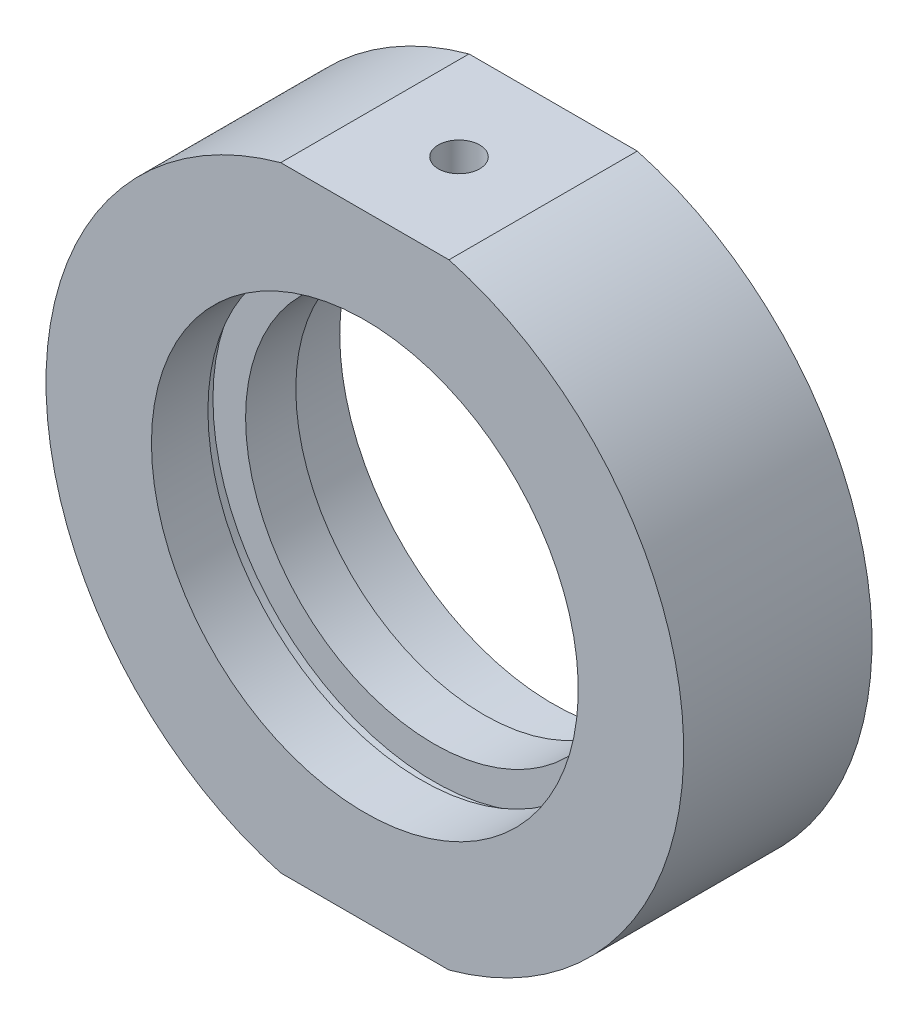
ISO-10303-21;
HEADER;
FILE_DESCRIPTION(('STEP AP214'),'2;1');
FILE_NAME('part.step','',(''),(''),'','','');
FILE_SCHEMA(('AUTOMOTIVE_DESIGN { 1 0 10303 214 1 1 1 1 }'));
ENDSEC;
DATA;
#1=APPLICATION_CONTEXT('core data for automotive mechanical design processes');
#2=APPLICATION_PROTOCOL_DEFINITION('international standard','automotive_design',2000,#1);
#3=PRODUCT_CONTEXT('',#1,'mechanical');
#4=PRODUCT('Part','Part','',(#3));
#5=PRODUCT_RELATED_PRODUCT_CATEGORY('part','',(#4));
#6=PRODUCT_DEFINITION_FORMATION('','',#4);
#7=PRODUCT_DEFINITION_CONTEXT('part definition',#1,'design');
#8=PRODUCT_DEFINITION('design','',#6,#7);
#9=PRODUCT_DEFINITION_SHAPE('','',#8);
#10=(LENGTH_UNIT() NAMED_UNIT(*) SI_UNIT(.MILLI.,.METRE.));
#11=(NAMED_UNIT(*) PLANE_ANGLE_UNIT() SI_UNIT($,.RADIAN.));
#12=(NAMED_UNIT(*) SI_UNIT($,.STERADIAN.) SOLID_ANGLE_UNIT());
#13=UNCERTAINTY_MEASURE_WITH_UNIT(LENGTH_MEASURE(1.E-05),#10,'distance_accuracy_value','');
#14=(GEOMETRIC_REPRESENTATION_CONTEXT(3) GLOBAL_UNCERTAINTY_ASSIGNED_CONTEXT((#13)) GLOBAL_UNIT_ASSIGNED_CONTEXT((#10,
#11,#12)) REPRESENTATION_CONTEXT('',''));
#15=CARTESIAN_POINT('',(0.,0.,0.));
#16=DIRECTION('',(0.,0.,1.));
#17=DIRECTION('',(1.,0.,0.));
#18=AXIS2_PLACEMENT_3D('',#15,#16,#17);
#19=CARTESIAN_POINT('',(0.,0.,-31.9390681003584));
#20=DIRECTION('',(0.,0.,-1.));
#21=DIRECTION('',(-1.,0.,0.));
#22=AXIS2_PLACEMENT_3D('',#19,#20,#21);
#23=CYLINDRICAL_SURFACE('',#22,25.4);
#24=CARTESIAN_POINT('',(0.,0.,7.49999999999999));
#25=DIRECTION('',(0.,0.,-1.));
#26=DIRECTION('',(-1.,0.,0.));
#27=AXIS2_PLACEMENT_3D('',#24,#25,#26);
#28=CIRCLE('',#27,25.4);
#29=CARTESIAN_POINT('',(6.7014923711066,24.5,7.5));
#30=VERTEX_POINT('',#29);
#31=CARTESIAN_POINT('',(6.7014923711066,-24.5,7.5));
#32=VERTEX_POINT('',#31);
#33=EDGE_CURVE('E154',#30,#32,#28,.T.);
#34=ORIENTED_EDGE('',*,*,#33,.T.);
#35=DIRECTION('',(0.,0.,-1.));
#36=VECTOR('',#35,1.);
#37=CARTESIAN_POINT('',(6.70149237110663,-24.5,-31.9390681003584));
#38=LINE('',#37,#36);
#39=CARTESIAN_POINT('',(6.7014923711066,-24.5,-7.5));
#40=VERTEX_POINT('',#39);
#41=EDGE_CURVE('E119',#32,#40,#38,.T.);
#42=ORIENTED_EDGE('',*,*,#41,.T.);
#43=CARTESIAN_POINT('',(0.,0.,-7.5));
#44=DIRECTION('',(0.,0.,-1.));
#45=DIRECTION('',(-1.,0.,0.));
#46=AXIS2_PLACEMENT_3D('',#43,#44,#45);
#47=CIRCLE('',#46,25.4);
#48=CARTESIAN_POINT('',(6.7014923711066,24.5,-7.5));
#49=VERTEX_POINT('',#48);
#50=EDGE_CURVE('E149',#49,#40,#47,.T.);
#51=ORIENTED_EDGE('',*,*,#50,.F.);
#52=DIRECTION('',(0.,0.,-1.));
#53=VECTOR('',#52,1.);
#54=CARTESIAN_POINT('',(6.70149237110663,24.5,-31.9390681003584));
#55=LINE('',#54,#53);
#56=EDGE_CURVE('E64',#49,#30,#55,.F.);
#57=ORIENTED_EDGE('',*,*,#56,.T.);
#58=EDGE_LOOP('',(#34,#42,#51,#57));
#59=FACE_BOUND('',#58,.T.);
#60=ADVANCED_FACE('F41',(#59),#23,.T.);
#61=CARTESIAN_POINT('',(15.,0.,-2.));
#62=DIRECTION('',(0.,0.,1.));
#63=DIRECTION('',(1.,0.,0.));
#64=AXIS2_PLACEMENT_3D('',#61,#62,#63);
#65=PLANE('',#64);
#66=CARTESIAN_POINT('',(0.,0.,-2.));
#67=DIRECTION('',(0.,0.,-1.));
#68=DIRECTION('',(-1.,0.,0.));
#69=AXIS2_PLACEMENT_3D('',#66,#67,#68);
#70=CIRCLE('',#69,15.);
#71=CARTESIAN_POINT('',(-15.,0.,-2.));
#72=VERTEX_POINT('',#71);
#73=EDGE_CURVE('E177',#72,#72,#70,.T.);
#74=ORIENTED_EDGE('',*,*,#73,.F.);
#75=EDGE_LOOP('',(#74));
#76=FACE_BOUND('',#75,.T.);
#77=CARTESIAN_POINT('',(0.,0.,-2.));
#78=DIRECTION('',(0.,0.,-1.));
#79=DIRECTION('',(-1.,0.,0.));
#80=AXIS2_PLACEMENT_3D('',#77,#78,#79);
#81=CIRCLE('',#80,17.6);
#82=CARTESIAN_POINT('',(-17.6,0.,-2.));
#83=VERTEX_POINT('',#82);
#84=EDGE_CURVE('E132',#83,#83,#81,.T.);
#85=ORIENTED_EDGE('',*,*,#84,.T.);
#86=EDGE_LOOP('',(#85));
#87=FACE_BOUND('',#86,.T.);
#88=ADVANCED_FACE('F43',(#76,#87),#65,.F.);
#89=CARTESIAN_POINT('',(0.,0.,-31.9390681003584));
#90=DIRECTION('',(0.,0.,-1.));
#91=DIRECTION('',(-1.,0.,0.));
#92=AXIS2_PLACEMENT_3D('',#89,#90,#91);
#93=CYLINDRICAL_SURFACE('',#92,15.);
#94=CARTESIAN_POINT('',(0.,0.,1.99999999999999));
#95=DIRECTION('',(0.,0.,-1.));
#96=DIRECTION('',(-1.,0.,0.));
#97=AXIS2_PLACEMENT_3D('',#94,#95,#96);
#98=CIRCLE('',#97,15.);
#99=CARTESIAN_POINT('',(-15.,0.,2.));
#100=VERTEX_POINT('',#99);
#101=EDGE_CURVE('E173',#100,#100,#98,.T.);
#102=ORIENTED_EDGE('',*,*,#101,.F.);
#103=EDGE_LOOP('',(#102));
#104=FACE_BOUND('',#103,.T.);
#105=ORIENTED_EDGE('',*,*,#73,.T.);
#106=EDGE_LOOP('',(#105));
#107=FACE_BOUND('',#106,.T.);
#108=ADVANCED_FACE('F218',(#104,#107),#93,.F.);
#109=CARTESIAN_POINT('',(17.6,0.,2.));
#110=DIRECTION('',(0.,0.,-1.));
#111=DIRECTION('',(-1.,0.,0.));
#112=AXIS2_PLACEMENT_3D('',#109,#110,#111);
#113=PLANE('',#112);
#114=CARTESIAN_POINT('',(0.,0.,1.99999999999999));
#115=DIRECTION('',(0.,0.,-1.));
#116=DIRECTION('',(-1.,0.,0.));
#117=AXIS2_PLACEMENT_3D('',#114,#115,#116);
#118=CIRCLE('',#117,17.6);
#119=CARTESIAN_POINT('',(-17.6,0.,2.));
#120=VERTEX_POINT('',#119);
#121=EDGE_CURVE('E169',#120,#120,#118,.T.);
#122=ORIENTED_EDGE('',*,*,#121,.F.);
#123=EDGE_LOOP('',(#122));
#124=FACE_BOUND('',#123,.T.);
#125=ORIENTED_EDGE('',*,*,#101,.T.);
#126=EDGE_LOOP('',(#125));
#127=FACE_BOUND('',#126,.T.);
#128=ADVANCED_FACE('F243',(#124,#127),#113,.F.);
#129=CARTESIAN_POINT('',(0.,0.,-31.9390681003584));
#130=DIRECTION('',(0.,0.,-1.));
#131=DIRECTION('',(-1.,0.,0.));
#132=AXIS2_PLACEMENT_3D('',#129,#130,#131);
#133=CYLINDRICAL_SURFACE('',#132,17.6);
#134=CARTESIAN_POINT('',(0.,0.,3.));
#135=DIRECTION('',(0.,0.,-1.));
#136=DIRECTION('',(-1.,0.,0.));
#137=AXIS2_PLACEMENT_3D('',#134,#135,#136);
#138=CIRCLE('',#137,17.6);
#139=CARTESIAN_POINT('',(-17.6,0.,3.));
#140=VERTEX_POINT('',#139);
#141=EDGE_CURVE('E166',#140,#140,#138,.T.);
#142=ORIENTED_EDGE('',*,*,#141,.F.);
#143=EDGE_LOOP('',(#142));
#144=FACE_BOUND('',#143,.T.);
#145=ORIENTED_EDGE('',*,*,#121,.T.);
#146=EDGE_LOOP('',(#145));
#147=FACE_BOUND('',#146,.T.);
#148=ADVANCED_FACE('F239',(#144,#147),#133,.F.);
#149=CARTESIAN_POINT('',(17.6,0.,3.));
#150=DIRECTION('',(0.,0.,1.));
#151=DIRECTION('',(1.,0.,0.));
#152=AXIS2_PLACEMENT_3D('',#149,#150,#151);
#153=PLANE('',#152);
#154=CARTESIAN_POINT('',(0.,0.,3.));
#155=DIRECTION('',(0.,0.,-1.));
#156=DIRECTION('',(-1.,0.,0.));
#157=AXIS2_PLACEMENT_3D('',#154,#155,#156);
#158=CIRCLE('',#157,17.);
#159=CARTESIAN_POINT('',(-17.,0.,3.));
#160=VERTEX_POINT('',#159);
#161=EDGE_CURVE('E162',#160,#160,#158,.T.);
#162=ORIENTED_EDGE('',*,*,#161,.F.);
#163=EDGE_LOOP('',(#162));
#164=FACE_BOUND('',#163,.T.);
#165=ORIENTED_EDGE('',*,*,#141,.T.);
#166=EDGE_LOOP('',(#165));
#167=FACE_BOUND('',#166,.T.);
#168=ADVANCED_FACE('F233',(#164,#167),#153,.F.);
#169=CARTESIAN_POINT('',(0.,0.,-31.9390681003584));
#170=DIRECTION('',(0.,0.,-1.));
#171=DIRECTION('',(-1.,0.,0.));
#172=AXIS2_PLACEMENT_3D('',#169,#170,#171);
#173=CYLINDRICAL_SURFACE('',#172,17.);
#174=CARTESIAN_POINT('',(0.,0.,7.5));
#175=DIRECTION('',(0.,0.,-1.));
#176=DIRECTION('',(-1.,0.,0.));
#177=AXIS2_PLACEMENT_3D('',#174,#175,#176);
#178=CIRCLE('',#177,17.);
#179=CARTESIAN_POINT('',(-17.,0.,7.5));
#180=VERTEX_POINT('',#179);
#181=EDGE_CURVE('E158',#180,#180,#178,.T.);
#182=ORIENTED_EDGE('',*,*,#181,.F.);
#183=EDGE_LOOP('',(#182));
#184=FACE_BOUND('',#183,.T.);
#185=ORIENTED_EDGE('',*,*,#161,.T.);
#186=EDGE_LOOP('',(#185));
#187=FACE_BOUND('',#186,.T.);
#188=ADVANCED_FACE('F229',(#184,#187),#173,.F.);
#189=CARTESIAN_POINT('',(25.4,0.,7.5));
#190=DIRECTION('',(0.,0.,-1.));
#191=DIRECTION('',(-1.,0.,0.));
#192=AXIS2_PLACEMENT_3D('',#189,#190,#191);
#193=PLANE('',#192);
#194=CARTESIAN_POINT('',(-6.70149237110659,-24.5,7.5));
#195=VERTEX_POINT('',#194);
#196=CARTESIAN_POINT('',(-6.70149237110659,24.5,7.5));
#197=VERTEX_POINT('',#196);
#198=EDGE_CURVE('E153',#195,#197,#28,.T.);
#199=ORIENTED_EDGE('',*,*,#198,.F.);
#200=DIRECTION('',(-1.,0.,0.));
#201=VECTOR('',#200,1.);
#202=CARTESIAN_POINT('',(-33.1519726534682,-24.5,7.5));
#203=LINE('',#202,#201);
#204=EDGE_CURVE('E114',#32,#195,#203,.T.);
#205=ORIENTED_EDGE('',*,*,#204,.F.);
#206=ORIENTED_EDGE('',*,*,#33,.F.);
#207=DIRECTION('',(1.,0.,0.));
#208=VECTOR('',#207,1.);
#209=CARTESIAN_POINT('',(-33.1519726534682,24.5,7.5));
#210=LINE('',#209,#208);
#211=EDGE_CURVE('E123',#197,#30,#210,.T.);
#212=ORIENTED_EDGE('',*,*,#211,.F.);
#213=EDGE_LOOP('',(#199,#205,#206,#212));
#214=FACE_BOUND('',#213,.T.);
#215=ORIENTED_EDGE('',*,*,#181,.T.);
#216=EDGE_LOOP('',(#215));
#217=FACE_BOUND('',#216,.T.);
#218=ADVANCED_FACE('F191',(#214,#217),#193,.F.);
#219=CARTESIAN_POINT('',(-6.70149237110659,-24.5,-7.5));
#220=VERTEX_POINT('',#219);
#221=CARTESIAN_POINT('',(-6.70149237110659,24.5,-7.5));
#222=VERTEX_POINT('',#221);
#223=EDGE_CURVE('E148',#220,#222,#47,.T.);
#224=ORIENTED_EDGE('',*,*,#223,.F.);
#225=DIRECTION('',(0.,0.,-1.));
#226=VECTOR('',#225,1.);
#227=CARTESIAN_POINT('',(-6.70149237110663,-24.5,-31.9390681003584));
#228=LINE('',#227,#226);
#229=EDGE_CURVE('E57',#220,#195,#228,.F.);
#230=ORIENTED_EDGE('',*,*,#229,.T.);
#231=ORIENTED_EDGE('',*,*,#198,.T.);
#232=DIRECTION('',(0.,0.,-1.));
#233=VECTOR('',#232,1.);
#234=CARTESIAN_POINT('',(-6.70149237110663,24.5,-31.9390681003584));
#235=LINE('',#234,#233);
#236=EDGE_CURVE('E128',#197,#222,#235,.T.);
#237=ORIENTED_EDGE('',*,*,#236,.T.);
#238=EDGE_LOOP('',(#224,#230,#231,#237));
#239=FACE_BOUND('',#238,.T.);
#240=ADVANCED_FACE('F196',(#239),#23,.T.);
#241=CARTESIAN_POINT('',(17.,0.,-7.5));
#242=DIRECTION('',(0.,0.,1.));
#243=DIRECTION('',(1.,0.,0.));
#244=AXIS2_PLACEMENT_3D('',#241,#242,#243);
#245=PLANE('',#244);
#246=CARTESIAN_POINT('',(0.,0.,-7.5));
#247=DIRECTION('',(0.,0.,-1.));
#248=DIRECTION('',(-1.,0.,0.));
#249=AXIS2_PLACEMENT_3D('',#246,#247,#248);
#250=CIRCLE('',#249,17.);
#251=CARTESIAN_POINT('',(-17.,0.,-7.5));
#252=VERTEX_POINT('',#251);
#253=EDGE_CURVE('E144',#252,#252,#250,.T.);
#254=ORIENTED_EDGE('',*,*,#253,.F.);
#255=EDGE_LOOP('',(#254));
#256=FACE_BOUND('',#255,.T.);
#257=ORIENTED_EDGE('',*,*,#50,.T.);
#258=DIRECTION('',(-1.,0.,0.));
#259=VECTOR('',#258,1.);
#260=CARTESIAN_POINT('',(17.,-24.5,-7.5));
#261=LINE('',#260,#259);
#262=EDGE_CURVE('E11',#40,#220,#261,.T.);
#263=ORIENTED_EDGE('',*,*,#262,.T.);
#264=ORIENTED_EDGE('',*,*,#223,.T.);
#265=DIRECTION('',(1.,0.,0.));
#266=VECTOR('',#265,1.);
#267=CARTESIAN_POINT('',(17.,24.5,-7.5));
#268=LINE('',#267,#266);
#269=EDGE_CURVE('E50',#222,#49,#268,.T.);
#270=ORIENTED_EDGE('',*,*,#269,.T.);
#271=EDGE_LOOP('',(#257,#263,#264,#270));
#272=FACE_BOUND('',#271,.T.);
#273=ADVANCED_FACE('F182',(#256,#272),#245,.F.);
#274=CARTESIAN_POINT('',(0.,0.,-31.9390681003584));
#275=DIRECTION('',(0.,0.,-1.));
#276=DIRECTION('',(-1.,0.,0.));
#277=AXIS2_PLACEMENT_3D('',#274,#275,#276);
#278=CYLINDRICAL_SURFACE('',#277,17.);
#279=CARTESIAN_POINT('',(0.,0.,-3.));
#280=DIRECTION('',(0.,0.,-1.));
#281=DIRECTION('',(-1.,0.,0.));
#282=AXIS2_PLACEMENT_3D('',#279,#280,#281);
#283=CIRCLE('',#282,17.);
#284=CARTESIAN_POINT('',(-17.,0.,-3.));
#285=VERTEX_POINT('',#284);
#286=EDGE_CURVE('E140',#285,#285,#283,.T.);
#287=ORIENTED_EDGE('',*,*,#286,.F.);
#288=EDGE_LOOP('',(#287));
#289=FACE_BOUND('',#288,.T.);
#290=ORIENTED_EDGE('',*,*,#253,.T.);
#291=EDGE_LOOP('',(#290));
#292=FACE_BOUND('',#291,.T.);
#293=ADVANCED_FACE('F227',(#289,#292),#278,.F.);
#294=CARTESIAN_POINT('',(17.6,0.,-3.));
#295=DIRECTION('',(0.,0.,-1.));
#296=DIRECTION('',(-1.,0.,0.));
#297=AXIS2_PLACEMENT_3D('',#294,#295,#296);
#298=PLANE('',#297);
#299=CARTESIAN_POINT('',(0.,0.,-3.));
#300=DIRECTION('',(0.,0.,-1.));
#301=DIRECTION('',(-1.,0.,0.));
#302=AXIS2_PLACEMENT_3D('',#299,#300,#301);
#303=CIRCLE('',#302,17.6);
#304=CARTESIAN_POINT('',(-17.6,0.,-3.));
#305=VERTEX_POINT('',#304);
#306=EDGE_CURVE('E136',#305,#305,#303,.T.);
#307=ORIENTED_EDGE('',*,*,#306,.F.);
#308=EDGE_LOOP('',(#307));
#309=FACE_BOUND('',#308,.T.);
#310=ORIENTED_EDGE('',*,*,#286,.T.);
#311=EDGE_LOOP('',(#310));
#312=FACE_BOUND('',#311,.T.);
#313=ADVANCED_FACE('F209',(#309,#312),#298,.F.);
#314=CARTESIAN_POINT('',(0.,0.,-31.9390681003584));
#315=DIRECTION('',(0.,0.,-1.));
#316=DIRECTION('',(-1.,0.,0.));
#317=AXIS2_PLACEMENT_3D('',#314,#315,#316);
#318=CYLINDRICAL_SURFACE('',#317,17.6);
#319=ORIENTED_EDGE('',*,*,#84,.F.);
#320=EDGE_LOOP('',(#319));
#321=FACE_BOUND('',#320,.T.);
#322=ORIENTED_EDGE('',*,*,#306,.T.);
#323=EDGE_LOOP('',(#322));
#324=FACE_BOUND('',#323,.T.);
#325=ADVANCED_FACE('F199',(#321,#324),#318,.F.);
#326=CARTESIAN_POINT('',(-33.1519726534682,24.5,-41.5));
#327=DIRECTION('',(0.,-1.,0.));
#328=DIRECTION('',(0.,0.,-1.));
#329=AXIS2_PLACEMENT_3D('',#326,#327,#328);
#330=PLANE('',#329);
#331=CARTESIAN_POINT('',(0.,24.5,0.));
#332=DIRECTION('',(0.,1.,0.));
#333=DIRECTION('',(0.,0.,1.));
#334=AXIS2_PLACEMENT_3D('',#331,#332,#333);
#335=CIRCLE('',#334,1.64999999999999);
#336=CARTESIAN_POINT('',(0.,24.5,1.64999999999999));
#337=VERTEX_POINT('',#336);
#338=EDGE_CURVE('E98',#337,#337,#335,.T.);
#339=ORIENTED_EDGE('',*,*,#338,.F.);
#340=EDGE_LOOP('',(#339));
#341=FACE_BOUND('',#340,.T.);
#342=ORIENTED_EDGE('',*,*,#211,.T.);
#343=ORIENTED_EDGE('',*,*,#56,.F.);
#344=ORIENTED_EDGE('',*,*,#269,.F.);
#345=ORIENTED_EDGE('',*,*,#236,.F.);
#346=EDGE_LOOP('',(#342,#343,#344,#345));
#347=FACE_BOUND('',#346,.T.);
#348=ADVANCED_FACE('F197',(#341,#347),#330,.F.);
#349=CARTESIAN_POINT('',(-33.1519726534682,-24.5,-41.5));
#350=DIRECTION('',(0.,1.,0.));
#351=DIRECTION('',(0.,0.,1.));
#352=AXIS2_PLACEMENT_3D('',#349,#350,#351);
#353=PLANE('',#352);
#354=CARTESIAN_POINT('',(0.,-24.5,0.));
#355=DIRECTION('',(0.,-1.,0.));
#356=DIRECTION('',(0.,0.,-1.));
#357=AXIS2_PLACEMENT_3D('',#354,#355,#356);
#358=CIRCLE('',#357,2.5);
#359=CARTESIAN_POINT('',(0.,-24.5,-2.5));
#360=VERTEX_POINT('',#359);
#361=EDGE_CURVE('E99',#360,#360,#358,.T.);
#362=ORIENTED_EDGE('',*,*,#361,.F.);
#363=EDGE_LOOP('',(#362));
#364=FACE_BOUND('',#363,.T.);
#365=ORIENTED_EDGE('',*,*,#204,.T.);
#366=ORIENTED_EDGE('',*,*,#229,.F.);
#367=ORIENTED_EDGE('',*,*,#262,.F.);
#368=ORIENTED_EDGE('',*,*,#41,.F.);
#369=EDGE_LOOP('',(#365,#366,#367,#368));
#370=FACE_BOUND('',#369,.T.);
#371=ADVANCED_FACE('F188',(#364,#370),#353,.F.);
#372=CARTESIAN_POINT('',(0.,19.,0.));
#373=DIRECTION('',(0.,1.,0.));
#374=DIRECTION('',(0.,0.,1.));
#375=AXIS2_PLACEMENT_3D('',#372,#373,#374);
#376=CONICAL_SURFACE('',#375,1.65,1.02974425867665);
#377=CARTESIAN_POINT('',(0.,18.0085799786045,0.));
#378=VERTEX_POINT('',#377);
#379=VERTEX_LOOP('',#378);
#380=FACE_BOUND('',#379,.T.);
#381=CARTESIAN_POINT('',(0.,19.,0.));
#382=DIRECTION('',(0.,1.,0.));
#383=DIRECTION('',(0.,0.,1.));
#384=AXIS2_PLACEMENT_3D('',#381,#382,#383);
#385=CIRCLE('',#384,1.65);
#386=CARTESIAN_POINT('',(0.,19.,1.65));
#387=VERTEX_POINT('',#386);
#388=EDGE_CURVE('E105',#387,#387,#385,.T.);
#389=ORIENTED_EDGE('',*,*,#388,.T.);
#390=EDGE_LOOP('',(#389));
#391=FACE_BOUND('',#390,.T.);
#392=ADVANCED_FACE('F206',(#380,#391),#376,.F.);
#393=CARTESIAN_POINT('',(0.,24.5,0.));
#394=DIRECTION('',(0.,1.,0.));
#395=DIRECTION('',(0.,0.,1.));
#396=AXIS2_PLACEMENT_3D('',#393,#394,#395);
#397=CYLINDRICAL_SURFACE('',#396,1.64999999999999);
#398=ORIENTED_EDGE('',*,*,#388,.F.);
#399=EDGE_LOOP('',(#398));
#400=FACE_BOUND('',#399,.T.);
#401=ORIENTED_EDGE('',*,*,#338,.T.);
#402=EDGE_LOOP('',(#401));
#403=FACE_BOUND('',#402,.T.);
#404=ADVANCED_FACE('F91',(#400,#403),#397,.F.);
#405=CARTESIAN_POINT('',(0.,-19.,0.));
#406=DIRECTION('',(0.,-1.,0.));
#407=DIRECTION('',(0.,0.,-1.));
#408=AXIS2_PLACEMENT_3D('',#405,#406,#407);
#409=CONICAL_SURFACE('',#408,2.5,1.02974425867665);
#410=CARTESIAN_POINT('',(0.,-17.4978484524311,0.));
#411=VERTEX_POINT('',#410);
#412=VERTEX_LOOP('',#411);
#413=FACE_BOUND('',#412,.T.);
#414=CARTESIAN_POINT('',(0.,-19.,0.));
#415=DIRECTION('',(0.,-1.,0.));
#416=DIRECTION('',(0.,0.,-1.));
#417=AXIS2_PLACEMENT_3D('',#414,#415,#416);
#418=CIRCLE('',#417,2.5);
#419=CARTESIAN_POINT('',(0.,-19.,-2.5));
#420=VERTEX_POINT('',#419);
#421=EDGE_CURVE('E95',#420,#420,#418,.T.);
#422=ORIENTED_EDGE('',*,*,#421,.T.);
#423=EDGE_LOOP('',(#422));
#424=FACE_BOUND('',#423,.T.);
#425=ADVANCED_FACE('F87',(#413,#424),#409,.F.);
#426=CARTESIAN_POINT('',(0.,-24.5,0.));
#427=DIRECTION('',(0.,-1.,0.));
#428=DIRECTION('',(0.,0.,-1.));
#429=AXIS2_PLACEMENT_3D('',#426,#427,#428);
#430=CYLINDRICAL_SURFACE('',#429,2.5);
#431=ORIENTED_EDGE('',*,*,#421,.F.);
#432=EDGE_LOOP('',(#431));
#433=FACE_BOUND('',#432,.T.);
#434=ORIENTED_EDGE('',*,*,#361,.T.);
#435=EDGE_LOOP('',(#434));
#436=FACE_BOUND('',#435,.T.);
#437=ADVANCED_FACE('F90',(#433,#436),#430,.F.);
#438=CLOSED_SHELL('',(#60,#88,#108,#128,#148,#168,#188,#218,#240,#273,#293,#313,#325,#348,#371,
#392,#404,#425,#437));
#439=MANIFOLD_SOLID_BREP('B2',#438);
#440=ADVANCED_BREP_SHAPE_REPRESENTATION('',(#18,#439),#14);
#441=SHAPE_DEFINITION_REPRESENTATION(#9,#440);
ENDSEC;
END-ISO-10303-21;
